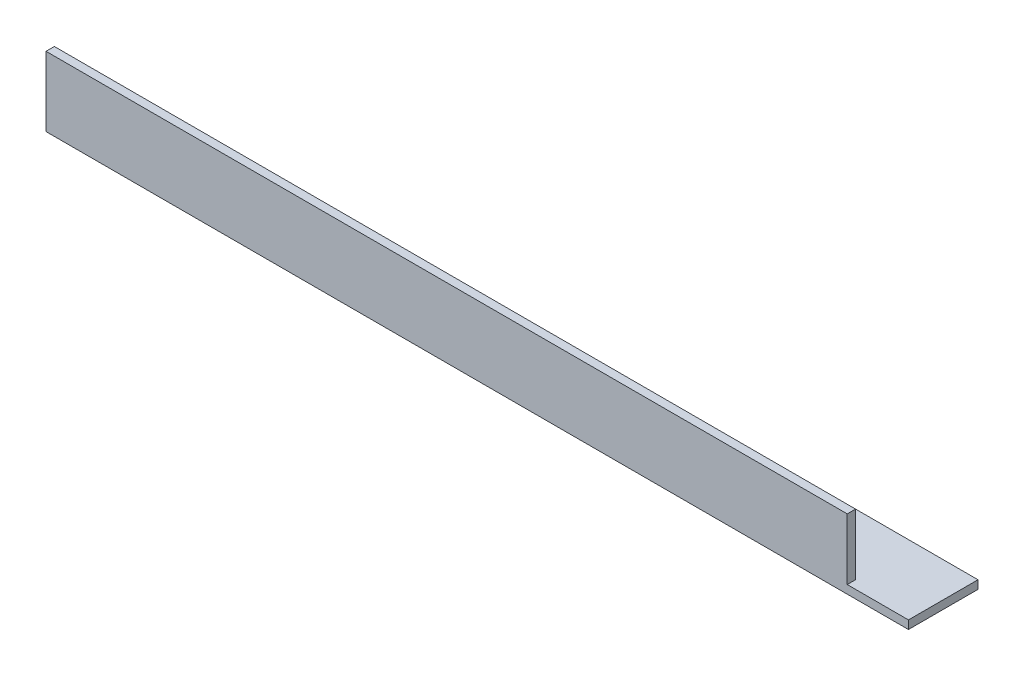
ISO-10303-21;
HEADER;
FILE_DESCRIPTION(('STEP AP214'),'2;1');
FILE_NAME('part.step','',(''),(''),'','','');
FILE_SCHEMA(('AUTOMOTIVE_DESIGN { 1 0 10303 214 1 1 1 1 }'));
ENDSEC;
DATA;
#1=APPLICATION_CONTEXT('core data for automotive mechanical design processes');
#2=APPLICATION_PROTOCOL_DEFINITION('international standard','automotive_design',2000,#1);
#3=PRODUCT_CONTEXT('',#1,'mechanical');
#4=PRODUCT('Part','Part','',(#3));
#5=PRODUCT_RELATED_PRODUCT_CATEGORY('part','',(#4));
#6=PRODUCT_DEFINITION_FORMATION('','',#4);
#7=PRODUCT_DEFINITION_CONTEXT('part definition',#1,'design');
#8=PRODUCT_DEFINITION('design','',#6,#7);
#9=PRODUCT_DEFINITION_SHAPE('','',#8);
#10=(LENGTH_UNIT() NAMED_UNIT(*) SI_UNIT(.MILLI.,.METRE.));
#11=(NAMED_UNIT(*) PLANE_ANGLE_UNIT() SI_UNIT($,.RADIAN.));
#12=(NAMED_UNIT(*) SI_UNIT($,.STERADIAN.) SOLID_ANGLE_UNIT());
#13=UNCERTAINTY_MEASURE_WITH_UNIT(LENGTH_MEASURE(1.E-05),#10,'distance_accuracy_value','');
#14=(GEOMETRIC_REPRESENTATION_CONTEXT(3) GLOBAL_UNCERTAINTY_ASSIGNED_CONTEXT((#13)) GLOBAL_UNIT_ASSIGNED_CONTEXT((#10,
#11,#12)) REPRESENTATION_CONTEXT('',''));
#15=CARTESIAN_POINT('',(0.,0.,0.));
#16=DIRECTION('',(0.,0.,1.));
#17=DIRECTION('',(1.,0.,0.));
#18=AXIS2_PLACEMENT_3D('',#15,#16,#17);
#19=CARTESIAN_POINT('',(310.,0.,-3.));
#20=DIRECTION('',(0.,0.,1.));
#21=DIRECTION('',(1.,0.,0.));
#22=AXIS2_PLACEMENT_3D('',#19,#20,#21);
#23=PLANE('',#22);
#24=DIRECTION('',(-1.,0.,0.));
#25=VECTOR('',#24,1.);
#26=CARTESIAN_POINT('',(310.,25.,-3.));
#27=LINE('',#26,#25);
#28=CARTESIAN_POINT('',(288.,25.,-3.));
#29=VERTEX_POINT('',#28);
#30=CARTESIAN_POINT('',(0.,25.,-3.));
#31=VERTEX_POINT('',#30);
#32=EDGE_CURVE('E11',#29,#31,#27,.T.);
#33=ORIENTED_EDGE('',*,*,#32,.F.);
#34=DIRECTION('',(0.,-1.,0.));
#35=VECTOR('',#34,1.);
#36=CARTESIAN_POINT('',(288.,0.,-3.));
#37=LINE('',#36,#35);
#38=CARTESIAN_POINT('',(288.,3.,-3.));
#39=VERTEX_POINT('',#38);
#40=EDGE_CURVE('E106',#29,#39,#37,.T.);
#41=ORIENTED_EDGE('',*,*,#40,.T.);
#42=DIRECTION('',(-1.,0.,0.));
#43=VECTOR('',#42,1.);
#44=CARTESIAN_POINT('',(310.,3.,-3.));
#45=LINE('',#44,#43);
#46=CARTESIAN_POINT('',(0.,3.,-3.));
#47=VERTEX_POINT('',#46);
#48=EDGE_CURVE('E80',#39,#47,#45,.T.);
#49=ORIENTED_EDGE('',*,*,#48,.T.);
#50=DIRECTION('',(0.,1.,0.));
#51=VECTOR('',#50,1.);
#52=CARTESIAN_POINT('',(0.,0.,-3.));
#53=LINE('',#52,#51);
#54=EDGE_CURVE('E138',#47,#31,#53,.T.);
#55=ORIENTED_EDGE('',*,*,#54,.T.);
#56=EDGE_LOOP('',(#33,#41,#49,#55));
#57=FACE_BOUND('',#56,.T.);
#58=ADVANCED_FACE('F32',(#57),#23,.F.);
#59=CARTESIAN_POINT('',(310.,25.,0.));
#60=DIRECTION('',(0.,1.,0.));
#61=DIRECTION('',(0.,0.,1.));
#62=AXIS2_PLACEMENT_3D('',#59,#60,#61);
#63=PLANE('',#62);
#64=DIRECTION('',(0.,0.,1.));
#65=VECTOR('',#64,1.);
#66=CARTESIAN_POINT('',(288.,25.,-25.));
#67=LINE('',#66,#65);
#68=CARTESIAN_POINT('',(288.,25.,0.));
#69=VERTEX_POINT('',#68);
#70=EDGE_CURVE('E101',#29,#69,#67,.T.);
#71=ORIENTED_EDGE('',*,*,#70,.F.);
#72=ORIENTED_EDGE('',*,*,#32,.T.);
#73=DIRECTION('',(0.,0.,-1.));
#74=VECTOR('',#73,1.);
#75=CARTESIAN_POINT('',(0.,25.,0.));
#76=LINE('',#75,#74);
#77=CARTESIAN_POINT('',(0.,25.,0.));
#78=VERTEX_POINT('',#77);
#79=EDGE_CURVE('E118',#78,#31,#76,.T.);
#80=ORIENTED_EDGE('',*,*,#79,.F.);
#81=DIRECTION('',(-1.,0.,0.));
#82=VECTOR('',#81,1.);
#83=CARTESIAN_POINT('',(310.,25.,0.));
#84=LINE('',#83,#82);
#85=EDGE_CURVE('E39',#69,#78,#84,.T.);
#86=ORIENTED_EDGE('',*,*,#85,.F.);
#87=EDGE_LOOP('',(#71,#72,#80,#86));
#88=FACE_BOUND('',#87,.T.);
#89=ADVANCED_FACE('F116',(#88),#63,.T.);
#90=CARTESIAN_POINT('',(310.,0.,0.));
#91=DIRECTION('',(0.,0.,1.));
#92=DIRECTION('',(1.,0.,0.));
#93=AXIS2_PLACEMENT_3D('',#90,#91,#92);
#94=PLANE('',#93);
#95=DIRECTION('',(1.,0.,0.));
#96=VECTOR('',#95,1.);
#97=CARTESIAN_POINT('',(310.,3.,0.));
#98=LINE('',#97,#96);
#99=CARTESIAN_POINT('',(288.,3.,0.));
#100=VERTEX_POINT('',#99);
#101=CARTESIAN_POINT('',(310.,3.,0.));
#102=VERTEX_POINT('',#101);
#103=EDGE_CURVE('E111',#100,#102,#98,.T.);
#104=ORIENTED_EDGE('',*,*,#103,.F.);
#105=DIRECTION('',(0.,-1.,0.));
#106=VECTOR('',#105,1.);
#107=CARTESIAN_POINT('',(288.,25.,0.));
#108=LINE('',#107,#106);
#109=EDGE_CURVE('E104',#69,#100,#108,.T.);
#110=ORIENTED_EDGE('',*,*,#109,.F.);
#111=ORIENTED_EDGE('',*,*,#85,.T.);
#112=DIRECTION('',(0.,1.,0.));
#113=VECTOR('',#112,1.);
#114=CARTESIAN_POINT('',(0.,0.,0.));
#115=LINE('',#114,#113);
#116=CARTESIAN_POINT('',(0.,0.,0.));
#117=VERTEX_POINT('',#116);
#118=EDGE_CURVE('E135',#117,#78,#115,.T.);
#119=ORIENTED_EDGE('',*,*,#118,.F.);
#120=DIRECTION('',(-1.,0.,0.));
#121=VECTOR('',#120,1.);
#122=CARTESIAN_POINT('',(310.,0.,0.));
#123=LINE('',#122,#121);
#124=CARTESIAN_POINT('',(310.,0.,0.));
#125=VERTEX_POINT('',#124);
#126=EDGE_CURVE('E86',#125,#117,#123,.T.);
#127=ORIENTED_EDGE('',*,*,#126,.F.);
#128=DIRECTION('',(0.,1.,0.));
#129=VECTOR('',#128,1.);
#130=CARTESIAN_POINT('',(310.,0.,0.));
#131=LINE('',#130,#129);
#132=EDGE_CURVE('E128',#125,#102,#131,.T.);
#133=ORIENTED_EDGE('',*,*,#132,.T.);
#134=EDGE_LOOP('',(#104,#110,#111,#119,#127,#133));
#135=FACE_BOUND('',#134,.T.);
#136=ADVANCED_FACE('F113',(#135),#94,.T.);
#137=CARTESIAN_POINT('',(310.,0.,0.));
#138=DIRECTION('',(0.,-1.,0.));
#139=DIRECTION('',(0.,0.,-1.));
#140=AXIS2_PLACEMENT_3D('',#137,#138,#139);
#141=PLANE('',#140);
#142=DIRECTION('',(0.,0.,1.));
#143=VECTOR('',#142,1.);
#144=CARTESIAN_POINT('',(0.,0.,0.));
#145=LINE('',#144,#143);
#146=CARTESIAN_POINT('',(0.,0.,-25.));
#147=VERTEX_POINT('',#146);
#148=EDGE_CURVE('E132',#147,#117,#145,.T.);
#149=ORIENTED_EDGE('',*,*,#148,.F.);
#150=DIRECTION('',(-1.,0.,0.));
#151=VECTOR('',#150,1.);
#152=CARTESIAN_POINT('',(310.,0.,-25.));
#153=LINE('',#152,#151);
#154=CARTESIAN_POINT('',(310.,0.,-25.));
#155=VERTEX_POINT('',#154);
#156=EDGE_CURVE('E120',#155,#147,#153,.T.);
#157=ORIENTED_EDGE('',*,*,#156,.F.);
#158=DIRECTION('',(0.,0.,1.));
#159=VECTOR('',#158,1.);
#160=CARTESIAN_POINT('',(310.,0.,0.));
#161=LINE('',#160,#159);
#162=EDGE_CURVE('E143',#155,#125,#161,.T.);
#163=ORIENTED_EDGE('',*,*,#162,.T.);
#164=ORIENTED_EDGE('',*,*,#126,.T.);
#165=EDGE_LOOP('',(#149,#157,#163,#164));
#166=FACE_BOUND('',#165,.T.);
#167=ADVANCED_FACE('F155',(#166),#141,.T.);
#168=CARTESIAN_POINT('',(310.,3.,-25.));
#169=DIRECTION('',(0.,0.,-1.));
#170=DIRECTION('',(-1.,0.,0.));
#171=AXIS2_PLACEMENT_3D('',#168,#169,#170);
#172=PLANE('',#171);
#173=DIRECTION('',(0.,-1.,0.));
#174=VECTOR('',#173,1.);
#175=CARTESIAN_POINT('',(0.,3.,-25.));
#176=LINE('',#175,#174);
#177=CARTESIAN_POINT('',(0.,3.,-25.));
#178=VERTEX_POINT('',#177);
#179=EDGE_CURVE('E129',#178,#147,#176,.T.);
#180=ORIENTED_EDGE('',*,*,#179,.F.);
#181=DIRECTION('',(-1.,0.,0.));
#182=VECTOR('',#181,1.);
#183=CARTESIAN_POINT('',(310.,3.,-25.));
#184=LINE('',#183,#182);
#185=CARTESIAN_POINT('',(310.,3.,-25.));
#186=VERTEX_POINT('',#185);
#187=EDGE_CURVE('E55',#186,#178,#184,.T.);
#188=ORIENTED_EDGE('',*,*,#187,.F.);
#189=DIRECTION('',(0.,-1.,0.));
#190=VECTOR('',#189,1.);
#191=CARTESIAN_POINT('',(310.,3.,-25.));
#192=LINE('',#191,#190);
#193=EDGE_CURVE('E141',#186,#155,#192,.T.);
#194=ORIENTED_EDGE('',*,*,#193,.T.);
#195=ORIENTED_EDGE('',*,*,#156,.T.);
#196=EDGE_LOOP('',(#180,#188,#194,#195));
#197=FACE_BOUND('',#196,.T.);
#198=ADVANCED_FACE('F156',(#197),#172,.T.);
#199=CARTESIAN_POINT('',(310.,3.,0.));
#200=DIRECTION('',(0.,-1.,0.));
#201=DIRECTION('',(0.,0.,-1.));
#202=AXIS2_PLACEMENT_3D('',#199,#200,#201);
#203=PLANE('',#202);
#204=ORIENTED_EDGE('',*,*,#48,.F.);
#205=DIRECTION('',(0.,0.,1.));
#206=VECTOR('',#205,1.);
#207=CARTESIAN_POINT('',(288.,3.,-25.));
#208=LINE('',#207,#206);
#209=EDGE_CURVE('E110',#39,#100,#208,.T.);
#210=ORIENTED_EDGE('',*,*,#209,.T.);
#211=ORIENTED_EDGE('',*,*,#103,.T.);
#212=DIRECTION('',(0.,0.,-1.));
#213=VECTOR('',#212,1.);
#214=CARTESIAN_POINT('',(310.,3.,0.));
#215=LINE('',#214,#213);
#216=EDGE_CURVE('E46',#186,#102,#215,.F.);
#217=ORIENTED_EDGE('',*,*,#216,.F.);
#218=ORIENTED_EDGE('',*,*,#187,.T.);
#219=DIRECTION('',(0.,0.,-1.));
#220=VECTOR('',#219,1.);
#221=CARTESIAN_POINT('',(0.,3.,0.));
#222=LINE('',#221,#220);
#223=EDGE_CURVE('E126',#178,#47,#222,.F.);
#224=ORIENTED_EDGE('',*,*,#223,.T.);
#225=EDGE_LOOP('',(#204,#210,#211,#217,#218,#224));
#226=FACE_BOUND('',#225,.T.);
#227=ADVANCED_FACE('F150',(#226),#203,.F.);
#228=CARTESIAN_POINT('',(310.,0.,0.));
#229=DIRECTION('',(-1.,0.,0.));
#230=DIRECTION('',(0.,0.,1.));
#231=AXIS2_PLACEMENT_3D('',#228,#229,#230);
#232=PLANE('',#231);
#233=ORIENTED_EDGE('',*,*,#216,.T.);
#234=ORIENTED_EDGE('',*,*,#132,.F.);
#235=ORIENTED_EDGE('',*,*,#162,.F.);
#236=ORIENTED_EDGE('',*,*,#193,.F.);
#237=EDGE_LOOP('',(#233,#234,#235,#236));
#238=FACE_BOUND('',#237,.T.);
#239=ADVANCED_FACE('F152',(#238),#232,.F.);
#240=CARTESIAN_POINT('',(0.,0.,0.));
#241=DIRECTION('',(-1.,0.,0.));
#242=DIRECTION('',(0.,0.,1.));
#243=AXIS2_PLACEMENT_3D('',#240,#241,#242);
#244=PLANE('',#243);
#245=ORIENTED_EDGE('',*,*,#54,.F.);
#246=ORIENTED_EDGE('',*,*,#223,.F.);
#247=ORIENTED_EDGE('',*,*,#179,.T.);
#248=ORIENTED_EDGE('',*,*,#148,.T.);
#249=ORIENTED_EDGE('',*,*,#118,.T.);
#250=ORIENTED_EDGE('',*,*,#79,.T.);
#251=EDGE_LOOP('',(#245,#246,#247,#248,#249,#250));
#252=FACE_BOUND('',#251,.T.);
#253=ADVANCED_FACE('F160',(#252),#244,.T.);
#254=CARTESIAN_POINT('',(288.,25.,-25.));
#255=DIRECTION('',(-1.,0.,0.));
#256=DIRECTION('',(0.,0.,1.));
#257=AXIS2_PLACEMENT_3D('',#254,#255,#256);
#258=PLANE('',#257);
#259=ORIENTED_EDGE('',*,*,#70,.T.);
#260=ORIENTED_EDGE('',*,*,#109,.T.);
#261=ORIENTED_EDGE('',*,*,#209,.F.);
#262=ORIENTED_EDGE('',*,*,#40,.F.);
#263=EDGE_LOOP('',(#259,#260,#261,#262));
#264=FACE_BOUND('',#263,.T.);
#265=ADVANCED_FACE('F103',(#264),#258,.F.);
#266=CLOSED_SHELL('',(#58,#89,#136,#167,#198,#227,#239,#253,#265));
#267=MANIFOLD_SOLID_BREP('B2',#266);
#268=ADVANCED_BREP_SHAPE_REPRESENTATION('',(#18,#267),#14);
#269=SHAPE_DEFINITION_REPRESENTATION(#9,#268);
ENDSEC;
END-ISO-10303-21;
